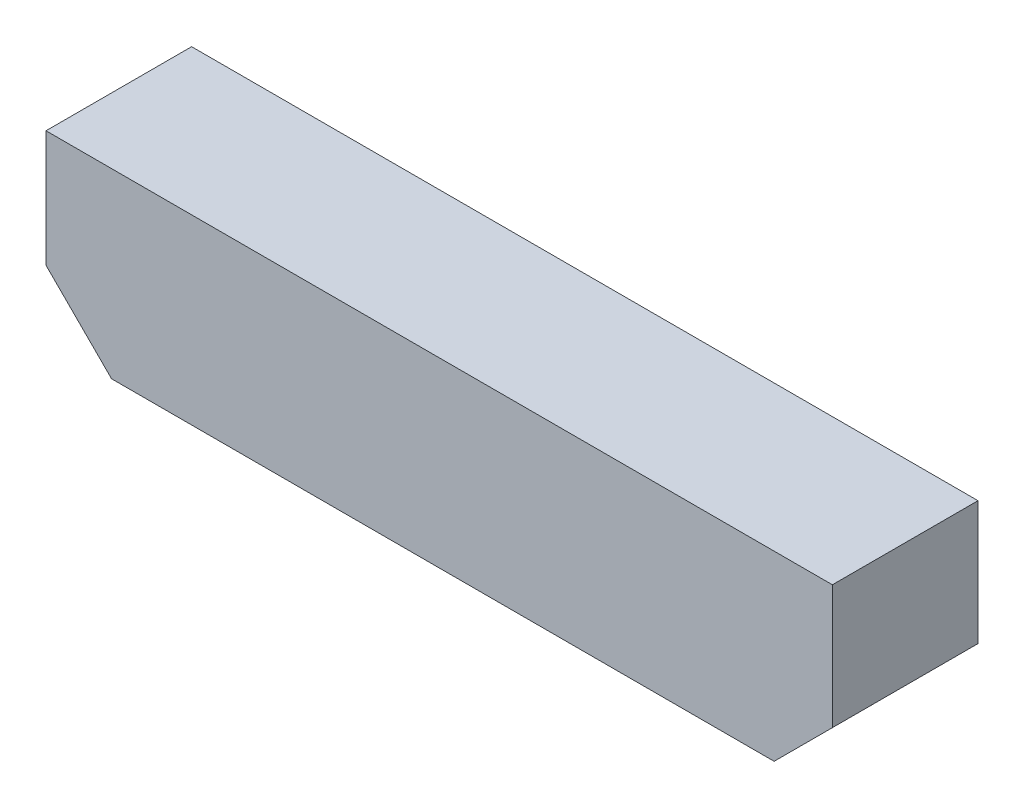
ISO-10303-21;
HEADER;
FILE_DESCRIPTION(('STEP AP214'),'2;1');
FILE_NAME('part.step','',(''),(''),'','','');
FILE_SCHEMA(('AUTOMOTIVE_DESIGN { 1 0 10303 214 1 1 1 1 }'));
ENDSEC;
DATA;
#1=APPLICATION_CONTEXT('core data for automotive mechanical design processes');
#2=APPLICATION_PROTOCOL_DEFINITION('international standard','automotive_design',2000,#1);
#3=PRODUCT_CONTEXT('',#1,'mechanical');
#4=PRODUCT('Part','Part','',(#3));
#5=PRODUCT_RELATED_PRODUCT_CATEGORY('part','',(#4));
#6=PRODUCT_DEFINITION_FORMATION('','',#4);
#7=PRODUCT_DEFINITION_CONTEXT('part definition',#1,'design');
#8=PRODUCT_DEFINITION('design','',#6,#7);
#9=PRODUCT_DEFINITION_SHAPE('','',#8);
#10=(LENGTH_UNIT() NAMED_UNIT(*) SI_UNIT(.MILLI.,.METRE.));
#11=(NAMED_UNIT(*) PLANE_ANGLE_UNIT() SI_UNIT($,.RADIAN.));
#12=(NAMED_UNIT(*) SI_UNIT($,.STERADIAN.) SOLID_ANGLE_UNIT());
#13=UNCERTAINTY_MEASURE_WITH_UNIT(LENGTH_MEASURE(1.E-05),#10,'distance_accuracy_value','');
#14=(GEOMETRIC_REPRESENTATION_CONTEXT(3) GLOBAL_UNCERTAINTY_ASSIGNED_CONTEXT((#13)) GLOBAL_UNIT_ASSIGNED_CONTEXT((#10,
#11,#12)) REPRESENTATION_CONTEXT('',''));
#15=CARTESIAN_POINT('',(0.,0.,0.));
#16=DIRECTION('',(0.,0.,1.));
#17=DIRECTION('',(1.,0.,0.));
#18=AXIS2_PLACEMENT_3D('',#15,#16,#17);
#19=CARTESIAN_POINT('',(2.69999968,0.62500002,1.00000054));
#20=DIRECTION('',(0.,0.,1.));
#21=DIRECTION('',(1.,0.,0.));
#22=AXIS2_PLACEMENT_3D('',#19,#20,#21);
#23=PLANE('',#22);
#24=DIRECTION('',(0.70710229103525,0.707111271309332,0.));
#25=VECTOR('',#24,1.);
#26=CARTESIAN_POINT('',(2.30000048,-0.62500002,1.00000054));
#27=LINE('',#26,#25);
#28=CARTESIAN_POINT('',(2.30000047999999,-0.625000019999994,1.00000054));
#29=VERTEX_POINT('',#28);
#30=CARTESIAN_POINT('',(2.69999714,-0.22499828,1.00000054));
#31=VERTEX_POINT('',#30);
#32=EDGE_CURVE('E19',#29,#31,#27,.T.);
#33=ORIENTED_EDGE('',*,*,#32,.T.);
#34=DIRECTION('',(0.,1.,0.));
#35=VECTOR('',#34,1.);
#36=CARTESIAN_POINT('',(2.69999714,0.62500002,1.00000054));
#37=LINE('',#36,#35);
#38=CARTESIAN_POINT('',(2.69999841,0.62500002,1.00000054));
#39=VERTEX_POINT('',#38);
#40=EDGE_CURVE('E71',#31,#39,#37,.T.);
#41=ORIENTED_EDGE('',*,*,#40,.T.);
#42=DIRECTION('',(1.,0.,0.));
#43=VECTOR('',#42,1.);
#44=CARTESIAN_POINT('',(-2.69999968,0.62500002,1.00000054));
#45=LINE('',#44,#43);
#46=CARTESIAN_POINT('',(-2.69999968,0.62500002,1.00000054));
#47=VERTEX_POINT('',#46);
#48=EDGE_CURVE('E86',#47,#39,#45,.T.);
#49=ORIENTED_EDGE('',*,*,#48,.F.);
#50=DIRECTION('',(0.,1.,0.));
#51=VECTOR('',#50,1.);
#52=CARTESIAN_POINT('',(-2.69999968,-0.17500092,1.00000054));
#53=LINE('',#52,#51);
#54=CARTESIAN_POINT('',(-2.69999968,-0.17500092,1.00000054));
#55=VERTEX_POINT('',#54);
#56=EDGE_CURVE('E66',#55,#47,#53,.T.);
#57=ORIENTED_EDGE('',*,*,#56,.F.);
#58=DIRECTION('',(0.707106781186548,-0.707106781186548,0.));
#59=VECTOR('',#58,1.);
#60=CARTESIAN_POINT('',(-2.25000058,-0.62500002,1.00000054));
#61=LINE('',#60,#59);
#62=CARTESIAN_POINT('',(-2.25000058,-0.62500002,1.00000054));
#63=VERTEX_POINT('',#62);
#64=EDGE_CURVE('E92',#63,#55,#61,.F.);
#65=ORIENTED_EDGE('',*,*,#64,.F.);
#66=DIRECTION('',(1.,0.,0.));
#67=VECTOR('',#66,1.);
#68=CARTESIAN_POINT('',(2.30000048,-0.62500002,1.00000054));
#69=LINE('',#68,#67);
#70=EDGE_CURVE('E74',#29,#63,#69,.F.);
#71=ORIENTED_EDGE('',*,*,#70,.F.);
#72=EDGE_LOOP('',(#33,#41,#49,#57,#65,#71));
#73=FACE_BOUND('',#72,.T.);
#74=ADVANCED_FACE('F16',(#73),#23,.T.);
#75=CARTESIAN_POINT('',(-2.69999968,0.62500002,0.));
#76=DIRECTION('',(0.,1.,0.));
#77=DIRECTION('',(0.,0.,1.));
#78=AXIS2_PLACEMENT_3D('',#75,#76,#77);
#79=PLANE('',#78);
#80=DIRECTION('',(0.,0.,1.));
#81=VECTOR('',#80,1.);
#82=CARTESIAN_POINT('',(2.69999968,0.62500002,0.));
#83=LINE('',#82,#81);
#84=CARTESIAN_POINT('',(2.699999045,0.62500002,0.));
#85=VERTEX_POINT('',#84);
#86=EDGE_CURVE('E81',#85,#39,#83,.T.);
#87=ORIENTED_EDGE('',*,*,#86,.F.);
#88=DIRECTION('',(1.,0.,0.));
#89=VECTOR('',#88,1.);
#90=CARTESIAN_POINT('',(2.69999968,0.62500002,0.));
#91=LINE('',#90,#89);
#92=CARTESIAN_POINT('',(-2.69999968,0.62500002,0.));
#93=VERTEX_POINT('',#92);
#94=EDGE_CURVE('E80',#85,#93,#91,.F.);
#95=ORIENTED_EDGE('',*,*,#94,.T.);
#96=DIRECTION('',(0.,0.,1.));
#97=VECTOR('',#96,1.);
#98=CARTESIAN_POINT('',(-2.69999968,0.62500002,0.));
#99=LINE('',#98,#97);
#100=EDGE_CURVE('E90',#47,#93,#99,.F.);
#101=ORIENTED_EDGE('',*,*,#100,.F.);
#102=ORIENTED_EDGE('',*,*,#48,.T.);
#103=EDGE_LOOP('',(#87,#95,#101,#102));
#104=FACE_BOUND('',#103,.T.);
#105=ADVANCED_FACE('F126',(#104),#79,.T.);
#106=CARTESIAN_POINT('',(-2.69999968,-0.17500092,0.));
#107=DIRECTION('',(-1.,0.,0.));
#108=DIRECTION('',(0.,0.,1.));
#109=AXIS2_PLACEMENT_3D('',#106,#107,#108);
#110=PLANE('',#109);
#111=ORIENTED_EDGE('',*,*,#100,.T.);
#112=DIRECTION('',(0.,1.,0.));
#113=VECTOR('',#112,1.);
#114=CARTESIAN_POINT('',(-2.69999968,0.62500002,0.));
#115=LINE('',#114,#113);
#116=CARTESIAN_POINT('',(-2.69999968,-0.17500092,0.));
#117=VERTEX_POINT('',#116);
#118=EDGE_CURVE('E104',#93,#117,#115,.F.);
#119=ORIENTED_EDGE('',*,*,#118,.T.);
#120=DIRECTION('',(0.,0.,1.));
#121=VECTOR('',#120,1.);
#122=CARTESIAN_POINT('',(-2.69999968,-0.17500092,0.));
#123=LINE('',#122,#121);
#124=EDGE_CURVE('E94',#55,#117,#123,.F.);
#125=ORIENTED_EDGE('',*,*,#124,.F.);
#126=ORIENTED_EDGE('',*,*,#56,.T.);
#127=EDGE_LOOP('',(#111,#119,#125,#126));
#128=FACE_BOUND('',#127,.T.);
#129=ADVANCED_FACE('F123',(#128),#110,.T.);
#130=CARTESIAN_POINT('',(-2.25000058,-0.62500002,0.));
#131=DIRECTION('',(-0.707106781186548,-0.707106781186548,0.));
#132=DIRECTION('',(0.707106781186548,-0.707106781186548,0.));
#133=AXIS2_PLACEMENT_3D('',#130,#131,#132);
#134=PLANE('',#133);
#135=ORIENTED_EDGE('',*,*,#124,.T.);
#136=DIRECTION('',(0.707106781186548,-0.707106781186548,0.));
#137=VECTOR('',#136,1.);
#138=CARTESIAN_POINT('',(-2.69999968,-0.17500092,0.));
#139=LINE('',#138,#137);
#140=CARTESIAN_POINT('',(-2.25000058,-0.62500002,0.));
#141=VERTEX_POINT('',#140);
#142=EDGE_CURVE('E107',#117,#141,#139,.T.);
#143=ORIENTED_EDGE('',*,*,#142,.T.);
#144=DIRECTION('',(0.,0.,-1.));
#145=VECTOR('',#144,1.);
#146=CARTESIAN_POINT('',(-2.25000058,-0.62500002,0.));
#147=LINE('',#146,#145);
#148=EDGE_CURVE('E97',#63,#141,#147,.T.);
#149=ORIENTED_EDGE('',*,*,#148,.F.);
#150=ORIENTED_EDGE('',*,*,#64,.T.);
#151=EDGE_LOOP('',(#135,#143,#149,#150));
#152=FACE_BOUND('',#151,.T.);
#153=ADVANCED_FACE('F122',(#152),#134,.T.);
#154=CARTESIAN_POINT('',(2.30000048,-0.62500002,0.));
#155=DIRECTION('',(0.,-1.,0.));
#156=DIRECTION('',(0.,0.,-1.));
#157=AXIS2_PLACEMENT_3D('',#154,#155,#156);
#158=PLANE('',#157);
#159=ORIENTED_EDGE('',*,*,#148,.T.);
#160=DIRECTION('',(1.,0.,0.));
#161=VECTOR('',#160,1.);
#162=CARTESIAN_POINT('',(2.69999968,-0.62500002,0.));
#163=LINE('',#162,#161);
#164=CARTESIAN_POINT('',(2.30000047999999,-0.625000019999994,0.));
#165=VERTEX_POINT('',#164);
#166=EDGE_CURVE('E110',#141,#165,#163,.T.);
#167=ORIENTED_EDGE('',*,*,#166,.T.);
#168=DIRECTION('',(0.,0.,1.));
#169=VECTOR('',#168,1.);
#170=CARTESIAN_POINT('',(2.30000047999998,-0.625000019999977,0.));
#171=LINE('',#170,#169);
#172=EDGE_CURVE('E99',#29,#165,#171,.F.);
#173=ORIENTED_EDGE('',*,*,#172,.F.);
#174=ORIENTED_EDGE('',*,*,#70,.T.);
#175=EDGE_LOOP('',(#159,#167,#173,#174));
#176=FACE_BOUND('',#175,.T.);
#177=ADVANCED_FACE('F115',(#176),#158,.T.);
#178=CARTESIAN_POINT('',(2.69999714,-0.22499828,0.));
#179=DIRECTION('',(0.707111271309291,-0.707102291035291,0.));
#180=DIRECTION('',(0.707102291035291,0.707111271309291,0.));
#181=AXIS2_PLACEMENT_3D('',#178,#179,#180);
#182=PLANE('',#181);
#183=ORIENTED_EDGE('',*,*,#172,.T.);
#184=DIRECTION('',(0.70710229103525,0.707111271309332,0.));
#185=VECTOR('',#184,1.);
#186=CARTESIAN_POINT('',(2.30000048,-0.62500002,0.));
#187=LINE('',#186,#185);
#188=CARTESIAN_POINT('',(2.69999714,-0.22499828,0.));
#189=VERTEX_POINT('',#188);
#190=EDGE_CURVE('E25',#165,#189,#187,.T.);
#191=ORIENTED_EDGE('',*,*,#190,.T.);
#192=DIRECTION('',(0.,0.,1.));
#193=VECTOR('',#192,1.);
#194=CARTESIAN_POINT('',(2.69999714,-0.22499828,0.));
#195=LINE('',#194,#193);
#196=EDGE_CURVE('E33',#31,#189,#195,.F.);
#197=ORIENTED_EDGE('',*,*,#196,.F.);
#198=ORIENTED_EDGE('',*,*,#32,.F.);
#199=EDGE_LOOP('',(#183,#191,#197,#198));
#200=FACE_BOUND('',#199,.T.);
#201=ADVANCED_FACE('F78',(#200),#182,.T.);
#202=CARTESIAN_POINT('',(2.69999968,0.62500002,0.));
#203=DIRECTION('',(0.999999999995535,-2.98824126705261E-06,0.));
#204=DIRECTION('',(2.98824126705261E-06,0.999999999995535,0.));
#205=AXIS2_PLACEMENT_3D('',#202,#203,#204);
#206=PLANE('',#205);
#207=ORIENTED_EDGE('',*,*,#196,.T.);
#208=DIRECTION('',(0.,1.,0.));
#209=VECTOR('',#208,1.);
#210=CARTESIAN_POINT('',(2.69999714,0.62500002,0.));
#211=LINE('',#210,#209);
#212=EDGE_CURVE('E11',#189,#85,#211,.T.);
#213=ORIENTED_EDGE('',*,*,#212,.T.);
#214=ORIENTED_EDGE('',*,*,#86,.T.);
#215=ORIENTED_EDGE('',*,*,#40,.F.);
#216=EDGE_LOOP('',(#207,#213,#214,#215));
#217=FACE_BOUND('',#216,.T.);
#218=ADVANCED_FACE('F84',(#217),#206,.T.);
#219=CARTESIAN_POINT('',(2.69999968,0.62500002,0.));
#220=DIRECTION('',(0.,0.,1.));
#221=DIRECTION('',(1.,0.,0.));
#222=AXIS2_PLACEMENT_3D('',#219,#220,#221);
#223=PLANE('',#222);
#224=ORIENTED_EDGE('',*,*,#190,.F.);
#225=ORIENTED_EDGE('',*,*,#166,.F.);
#226=ORIENTED_EDGE('',*,*,#142,.F.);
#227=ORIENTED_EDGE('',*,*,#118,.F.);
#228=ORIENTED_EDGE('',*,*,#94,.F.);
#229=ORIENTED_EDGE('',*,*,#212,.F.);
#230=EDGE_LOOP('',(#224,#225,#226,#227,#228,#229));
#231=FACE_BOUND('',#230,.T.);
#232=ADVANCED_FACE('F119',(#231),#223,.F.);
#233=CLOSED_SHELL('',(#74,#105,#129,#153,#177,#201,#218,#232));
#234=MANIFOLD_SOLID_BREP('B1',#233);
#235=ADVANCED_BREP_SHAPE_REPRESENTATION('',(#18,#234),#14);
#236=SHAPE_DEFINITION_REPRESENTATION(#9,#235);
ENDSEC;
END-ISO-10303-21;
